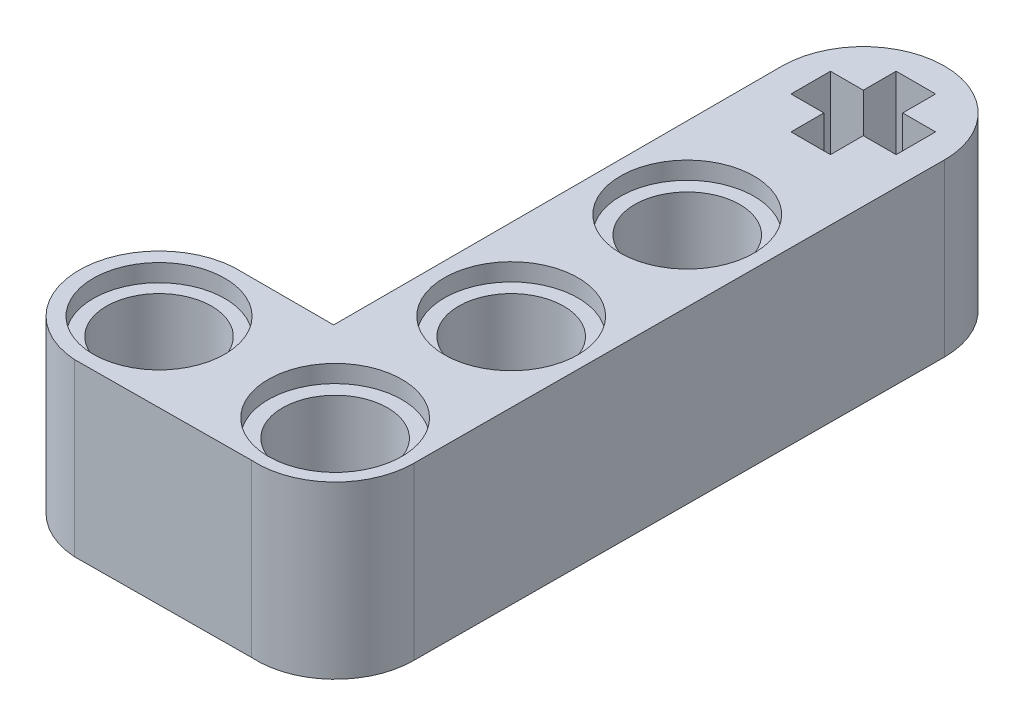
ISO-10303-21;
HEADER;
FILE_DESCRIPTION(('STEP AP214'),'2;1');
FILE_NAME('part.step','',(''),(''),'','','');
FILE_SCHEMA(('AUTOMOTIVE_DESIGN { 1 0 10303 214 1 1 1 1 }'));
ENDSEC;
DATA;
#1=APPLICATION_CONTEXT('core data for automotive mechanical design processes');
#2=APPLICATION_PROTOCOL_DEFINITION('international standard','automotive_design',2000,#1);
#3=PRODUCT_CONTEXT('',#1,'mechanical');
#4=PRODUCT('Part','Part','',(#3));
#5=PRODUCT_RELATED_PRODUCT_CATEGORY('part','',(#4));
#6=PRODUCT_DEFINITION_FORMATION('','',#4);
#7=PRODUCT_DEFINITION_CONTEXT('part definition',#1,'design');
#8=PRODUCT_DEFINITION('design','',#6,#7);
#9=PRODUCT_DEFINITION_SHAPE('','',#8);
#10=(LENGTH_UNIT() NAMED_UNIT(*) SI_UNIT(.MILLI.,.METRE.));
#11=(NAMED_UNIT(*) PLANE_ANGLE_UNIT() SI_UNIT($,.RADIAN.));
#12=(NAMED_UNIT(*) SI_UNIT($,.STERADIAN.) SOLID_ANGLE_UNIT());
#13=UNCERTAINTY_MEASURE_WITH_UNIT(LENGTH_MEASURE(1.E-05),#10,'distance_accuracy_value','');
#14=(GEOMETRIC_REPRESENTATION_CONTEXT(3) GLOBAL_UNCERTAINTY_ASSIGNED_CONTEXT((#13)) GLOBAL_UNIT_ASSIGNED_CONTEXT((#10,
#11,#12)) REPRESENTATION_CONTEXT('',''));
#15=CARTESIAN_POINT('',(0.,0.,0.));
#16=DIRECTION('',(0.,0.,1.));
#17=DIRECTION('',(1.,0.,0.));
#18=AXIS2_PLACEMENT_3D('',#15,#16,#17);
#19=CARTESIAN_POINT('',(-3.94907080353848,7.8,0.));
#20=DIRECTION('',(0.,-1.,0.));
#21=DIRECTION('',(0.,0.,-1.));
#22=AXIS2_PLACEMENT_3D('',#19,#20,#21);
#23=CYLINDRICAL_SURFACE('',#22,2.4);
#24=CARTESIAN_POINT('',(-3.94907080353848,7.,0.));
#25=DIRECTION('',(0.,1.,0.));
#26=DIRECTION('',(0.,0.,1.));
#27=AXIS2_PLACEMENT_3D('',#24,#25,#26);
#28=CIRCLE('',#27,2.4);
#29=CARTESIAN_POINT('',(-3.94907080353848,7.,2.4));
#30=VERTEX_POINT('',#29);
#31=EDGE_CURVE('E213',#30,#30,#28,.T.);
#32=ORIENTED_EDGE('',*,*,#31,.T.);
#33=EDGE_LOOP('',(#32));
#34=FACE_BOUND('',#33,.T.);
#35=CARTESIAN_POINT('',(-3.94907080353848,0.8,0.));
#36=DIRECTION('',(0.,-1.,0.));
#37=DIRECTION('',(0.,0.,-1.));
#38=AXIS2_PLACEMENT_3D('',#35,#36,#37);
#39=CIRCLE('',#38,2.4);
#40=CARTESIAN_POINT('',(-3.94907080353848,0.8,-2.4));
#41=VERTEX_POINT('',#40);
#42=EDGE_CURVE('E37',#41,#41,#39,.T.);
#43=ORIENTED_EDGE('',*,*,#42,.T.);
#44=EDGE_LOOP('',(#43));
#45=FACE_BOUND('',#44,.T.);
#46=ADVANCED_FACE('F33',(#34,#45),#23,.F.);
#47=CARTESIAN_POINT('',(4.09092919646151,7.8,0.));
#48=DIRECTION('',(0.,-1.,0.));
#49=DIRECTION('',(0.,0.,-1.));
#50=AXIS2_PLACEMENT_3D('',#47,#48,#49);
#51=CYLINDRICAL_SURFACE('',#50,2.4);
#52=CARTESIAN_POINT('',(4.09092919646151,7.,0.));
#53=DIRECTION('',(0.,1.,0.));
#54=DIRECTION('',(0.,0.,1.));
#55=AXIS2_PLACEMENT_3D('',#52,#53,#54);
#56=CIRCLE('',#55,2.4);
#57=CARTESIAN_POINT('',(4.09092919646151,7.,2.4));
#58=VERTEX_POINT('',#57);
#59=EDGE_CURVE('E316',#58,#58,#56,.T.);
#60=ORIENTED_EDGE('',*,*,#59,.T.);
#61=EDGE_LOOP('',(#60));
#62=FACE_BOUND('',#61,.T.);
#63=CARTESIAN_POINT('',(4.09092919646151,0.8,0.));
#64=DIRECTION('',(0.,-1.,0.));
#65=DIRECTION('',(0.,0.,-1.));
#66=AXIS2_PLACEMENT_3D('',#63,#64,#65);
#67=CIRCLE('',#66,2.4);
#68=CARTESIAN_POINT('',(4.09092919646151,0.8,-2.4));
#69=VERTEX_POINT('',#68);
#70=EDGE_CURVE('E327',#69,#69,#67,.T.);
#71=ORIENTED_EDGE('',*,*,#70,.T.);
#72=EDGE_LOOP('',(#71));
#73=FACE_BOUND('',#72,.T.);
#74=ADVANCED_FACE('F457',(#62,#73),#51,.F.);
#75=CARTESIAN_POINT('',(4.09092919646151,7.8,-16.08));
#76=DIRECTION('',(0.,-1.,0.));
#77=DIRECTION('',(0.,0.,-1.));
#78=AXIS2_PLACEMENT_3D('',#75,#76,#77);
#79=CYLINDRICAL_SURFACE('',#78,2.4);
#80=CARTESIAN_POINT('',(4.09092919646151,7.,-16.08));
#81=DIRECTION('',(0.,1.,0.));
#82=DIRECTION('',(0.,0.,1.));
#83=AXIS2_PLACEMENT_3D('',#80,#81,#82);
#84=CIRCLE('',#83,2.4);
#85=CARTESIAN_POINT('',(4.09092919646151,7.,-13.68));
#86=VERTEX_POINT('',#85);
#87=EDGE_CURVE('E312',#86,#86,#84,.T.);
#88=ORIENTED_EDGE('',*,*,#87,.T.);
#89=EDGE_LOOP('',(#88));
#90=FACE_BOUND('',#89,.T.);
#91=CARTESIAN_POINT('',(4.09092919646151,0.8,-16.08));
#92=DIRECTION('',(0.,-1.,0.));
#93=DIRECTION('',(0.,0.,-1.));
#94=AXIS2_PLACEMENT_3D('',#91,#92,#93);
#95=CIRCLE('',#94,2.4);
#96=CARTESIAN_POINT('',(4.09092919646151,0.8,-18.48));
#97=VERTEX_POINT('',#96);
#98=EDGE_CURVE('E324',#97,#97,#95,.T.);
#99=ORIENTED_EDGE('',*,*,#98,.T.);
#100=EDGE_LOOP('',(#99));
#101=FACE_BOUND('',#100,.T.);
#102=ADVANCED_FACE('F463',(#90,#101),#79,.F.);
#103=CARTESIAN_POINT('',(4.09092919646151,7.8,-8.04));
#104=DIRECTION('',(0.,-1.,0.));
#105=DIRECTION('',(0.,0.,-1.));
#106=AXIS2_PLACEMENT_3D('',#103,#104,#105);
#107=CYLINDRICAL_SURFACE('',#106,2.4);
#108=CARTESIAN_POINT('',(4.09092919646151,7.,-8.04));
#109=DIRECTION('',(0.,1.,0.));
#110=DIRECTION('',(0.,0.,1.));
#111=AXIS2_PLACEMENT_3D('',#108,#109,#110);
#112=CIRCLE('',#111,2.4);
#113=CARTESIAN_POINT('',(4.09092919646151,7.,-5.64));
#114=VERTEX_POINT('',#113);
#115=EDGE_CURVE('E309',#114,#114,#112,.T.);
#116=ORIENTED_EDGE('',*,*,#115,.T.);
#117=EDGE_LOOP('',(#116));
#118=FACE_BOUND('',#117,.T.);
#119=CARTESIAN_POINT('',(4.09092919646151,0.8,-8.04));
#120=DIRECTION('',(0.,-1.,0.));
#121=DIRECTION('',(0.,0.,-1.));
#122=AXIS2_PLACEMENT_3D('',#119,#120,#121);
#123=CIRCLE('',#122,2.4);
#124=CARTESIAN_POINT('',(4.09092919646151,0.8,-10.44));
#125=VERTEX_POINT('',#124);
#126=EDGE_CURVE('E321',#125,#125,#123,.T.);
#127=ORIENTED_EDGE('',*,*,#126,.T.);
#128=EDGE_LOOP('',(#127));
#129=FACE_BOUND('',#128,.T.);
#130=ADVANCED_FACE('F469',(#118,#129),#107,.F.);
#131=CARTESIAN_POINT('',(-3.94907080353848,7.8,0.));
#132=DIRECTION('',(0.,1.,0.));
#133=DIRECTION('',(0.,0.,1.));
#134=AXIS2_PLACEMENT_3D('',#131,#132,#133);
#135=PLANE('',#134);
#136=CARTESIAN_POINT('',(-3.94907080353848,7.8,0.));
#137=DIRECTION('',(0.,1.,0.));
#138=DIRECTION('',(0.,0.,1.));
#139=AXIS2_PLACEMENT_3D('',#136,#137,#138);
#140=CIRCLE('',#139,3.005);
#141=CARTESIAN_POINT('',(-3.94907080353848,7.8,3.005));
#142=VERTEX_POINT('',#141);
#143=EDGE_CURVE('E354',#142,#142,#140,.T.);
#144=ORIENTED_EDGE('',*,*,#143,.F.);
#145=EDGE_LOOP('',(#144));
#146=FACE_BOUND('',#145,.T.);
#147=CARTESIAN_POINT('',(4.09092919646151,7.8,0.));
#148=DIRECTION('',(0.,1.,0.));
#149=DIRECTION('',(0.,0.,1.));
#150=AXIS2_PLACEMENT_3D('',#147,#148,#149);
#151=CIRCLE('',#150,3.05);
#152=CARTESIAN_POINT('',(4.09092919646151,7.8,3.05));
#153=VERTEX_POINT('',#152);
#154=EDGE_CURVE('E348',#153,#153,#151,.T.);
#155=ORIENTED_EDGE('',*,*,#154,.F.);
#156=EDGE_LOOP('',(#155));
#157=FACE_BOUND('',#156,.T.);
#158=CARTESIAN_POINT('',(4.09092919646151,7.8,-8.04));
#159=DIRECTION('',(0.,1.,0.));
#160=DIRECTION('',(0.,0.,1.));
#161=AXIS2_PLACEMENT_3D('',#158,#159,#160);
#162=CIRCLE('',#161,3.05);
#163=CARTESIAN_POINT('',(4.09092919646151,7.8,-4.99));
#164=VERTEX_POINT('',#163);
#165=EDGE_CURVE('E340',#164,#164,#162,.T.);
#166=ORIENTED_EDGE('',*,*,#165,.F.);
#167=EDGE_LOOP('',(#166));
#168=FACE_BOUND('',#167,.T.);
#169=CARTESIAN_POINT('',(4.09092919646151,7.8,-16.08));
#170=DIRECTION('',(0.,1.,0.));
#171=DIRECTION('',(0.,0.,1.));
#172=AXIS2_PLACEMENT_3D('',#169,#170,#171);
#173=CIRCLE('',#172,3.05);
#174=CARTESIAN_POINT('',(4.09092919646151,7.8,-13.03));
#175=VERTEX_POINT('',#174);
#176=EDGE_CURVE('E332',#175,#175,#173,.T.);
#177=ORIENTED_EDGE('',*,*,#176,.F.);
#178=EDGE_LOOP('',(#177));
#179=FACE_BOUND('',#178,.T.);
#180=DIRECTION('',(1.,0.,0.));
#181=VECTOR('',#180,1.);
#182=CARTESIAN_POINT('',(4.99092919646151,7.8,-23.2200000000003));
#183=LINE('',#182,#181);
#184=CARTESIAN_POINT('',(4.99092919646151,7.8,-23.2200000000003));
#185=VERTEX_POINT('',#184);
#186=CARTESIAN_POINT('',(6.49092919646152,7.8,-23.2200000000003));
#187=VERTEX_POINT('',#186);
#188=EDGE_CURVE('E174',#185,#187,#183,.T.);
#189=ORIENTED_EDGE('',*,*,#188,.F.);
#190=DIRECTION('',(0.,0.,-1.));
#191=VECTOR('',#190,1.);
#192=CARTESIAN_POINT('',(4.99092919646151,7.8,-23.2200000000003));
#193=LINE('',#192,#191);
#194=CARTESIAN_POINT('',(4.99092919646151,7.8,-21.7200000000003));
#195=VERTEX_POINT('',#194);
#196=EDGE_CURVE('E166',#195,#185,#193,.T.);
#197=ORIENTED_EDGE('',*,*,#196,.F.);
#198=DIRECTION('',(1.,0.,0.));
#199=VECTOR('',#198,1.);
#200=CARTESIAN_POINT('',(3.19092919646151,7.8,-21.7200000000003));
#201=LINE('',#200,#199);
#202=CARTESIAN_POINT('',(3.19092919646151,7.8,-21.7200000000003));
#203=VERTEX_POINT('',#202);
#204=EDGE_CURVE('E210',#203,#195,#201,.T.);
#205=ORIENTED_EDGE('',*,*,#204,.F.);
#206=DIRECTION('',(0.,0.,1.));
#207=VECTOR('',#206,1.);
#208=CARTESIAN_POINT('',(3.19092919646151,7.8,-23.2200000000003));
#209=LINE('',#208,#207);
#210=CARTESIAN_POINT('',(3.19092919646151,7.8,-23.2200000000003));
#211=VERTEX_POINT('',#210);
#212=EDGE_CURVE('E208',#211,#203,#209,.T.);
#213=ORIENTED_EDGE('',*,*,#212,.F.);
#214=DIRECTION('',(1.,0.,0.));
#215=VECTOR('',#214,1.);
#216=CARTESIAN_POINT('',(1.69092919646151,7.8,-23.2200000000003));
#217=LINE('',#216,#215);
#218=CARTESIAN_POINT('',(1.69092919646151,7.8,-23.2200000000003));
#219=VERTEX_POINT('',#218);
#220=EDGE_CURVE('E206',#219,#211,#217,.T.);
#221=ORIENTED_EDGE('',*,*,#220,.F.);
#222=DIRECTION('',(0.,0.,1.));
#223=VECTOR('',#222,1.);
#224=CARTESIAN_POINT('',(1.69092919646151,7.8,-25.0200000000003));
#225=LINE('',#224,#223);
#226=CARTESIAN_POINT('',(1.69092919646151,7.8,-25.0200000000003));
#227=VERTEX_POINT('',#226);
#228=EDGE_CURVE('E204',#227,#219,#225,.T.);
#229=ORIENTED_EDGE('',*,*,#228,.F.);
#230=DIRECTION('',(-1.,0.,0.));
#231=VECTOR('',#230,1.);
#232=CARTESIAN_POINT('',(1.69092919646151,7.8,-25.0200000000003));
#233=LINE('',#232,#231);
#234=CARTESIAN_POINT('',(3.19092919646151,7.8,-25.0200000000003));
#235=VERTEX_POINT('',#234);
#236=EDGE_CURVE('E202',#235,#227,#233,.T.);
#237=ORIENTED_EDGE('',*,*,#236,.F.);
#238=DIRECTION('',(0.,0.,1.));
#239=VECTOR('',#238,1.);
#240=CARTESIAN_POINT('',(3.19092919646151,7.8,-26.5200000000003));
#241=LINE('',#240,#239);
#242=CARTESIAN_POINT('',(3.19092919646151,7.8,-26.5200000000003));
#243=VERTEX_POINT('',#242);
#244=EDGE_CURVE('E200',#243,#235,#241,.T.);
#245=ORIENTED_EDGE('',*,*,#244,.F.);
#246=DIRECTION('',(-1.,0.,0.));
#247=VECTOR('',#246,1.);
#248=CARTESIAN_POINT('',(3.19092919646151,7.8,-26.5200000000003));
#249=LINE('',#248,#247);
#250=CARTESIAN_POINT('',(4.99092919646151,7.8,-26.5200000000003));
#251=VERTEX_POINT('',#250);
#252=EDGE_CURVE('E198',#251,#243,#249,.T.);
#253=ORIENTED_EDGE('',*,*,#252,.F.);
#254=DIRECTION('',(0.,0.,-1.));
#255=VECTOR('',#254,1.);
#256=CARTESIAN_POINT('',(4.99092919646151,7.8,-26.5200000000003));
#257=LINE('',#256,#255);
#258=CARTESIAN_POINT('',(4.99092919646151,7.8,-25.0200000000003));
#259=VERTEX_POINT('',#258);
#260=EDGE_CURVE('E196',#259,#251,#257,.T.);
#261=ORIENTED_EDGE('',*,*,#260,.F.);
#262=DIRECTION('',(-1.,0.,0.));
#263=VECTOR('',#262,1.);
#264=CARTESIAN_POINT('',(4.99092919646151,7.8,-25.0200000000003));
#265=LINE('',#264,#263);
#266=CARTESIAN_POINT('',(6.49092919646151,7.8,-25.0200000000003));
#267=VERTEX_POINT('',#266);
#268=EDGE_CURVE('E191',#267,#259,#265,.T.);
#269=ORIENTED_EDGE('',*,*,#268,.F.);
#270=DIRECTION('',(0.,0.,-1.));
#271=VECTOR('',#270,1.);
#272=CARTESIAN_POINT('',(6.49092919646151,7.8,-25.0200000000003));
#273=LINE('',#272,#271);
#274=EDGE_CURVE('E189',#187,#267,#273,.T.);
#275=ORIENTED_EDGE('',*,*,#274,.F.);
#276=EDGE_LOOP('',(#189,#197,#205,#213,#221,#229,#237,#245,#253,#261,#269,#275));
#277=FACE_BOUND('',#276,.T.);
#278=CARTESIAN_POINT('',(-3.94907080353848,7.8,0.));
#279=DIRECTION('',(0.,1.,0.));
#280=DIRECTION('',(0.,0.,1.));
#281=AXIS2_PLACEMENT_3D('',#278,#279,#280);
#282=CIRCLE('',#281,3.65000206412482);
#283=CARTESIAN_POINT('',(-3.72319834090905,7.8,-3.64301068279919));
#284=VERTEX_POINT('',#283);
#285=CARTESIAN_POINT('',(-4.17494275523309,7.8,3.64300244212645));
#286=VERTEX_POINT('',#285);
#287=EDGE_CURVE('E263',#284,#286,#282,.T.);
#288=ORIENTED_EDGE('',*,*,#287,.T.);
#289=DIRECTION('',(0.999972162960093,0.,-0.00746145461117787));
#290=VECTOR('',#289,1.);
#291=CARTESIAN_POINT('',(-4.17494275523309,7.8,3.64300244212645));
#292=LINE('',#291,#290);
#293=CARTESIAN_POINT('',(3.86678286484987,7.8,3.58299780106507));
#294=VERTEX_POINT('',#293);
#295=EDGE_CURVE('E266',#286,#294,#292,.T.);
#296=ORIENTED_EDGE('',*,*,#295,.T.);
#297=CARTESIAN_POINT('',(4.09092919646151,7.8,0.));
#298=DIRECTION('',(0.,1.,0.));
#299=DIRECTION('',(0.,0.,1.));
#300=AXIS2_PLACEMENT_3D('',#297,#298,#299);
#301=CIRCLE('',#300,3.59000206412365);
#302=CARTESIAN_POINT('',(7.68092398356099,7.8,-0.00722834771103826));
#303=VERTEX_POINT('',#302);
#304=EDGE_CURVE('E269',#294,#303,#301,.T.);
#305=ORIENTED_EDGE('',*,*,#304,.T.);
#306=DIRECTION('',(0.00497694153571674,0.,-0.99998761494978));
#307=VECTOR('',#306,1.);
#308=CARTESIAN_POINT('',(7.68092398356099,7.8,-0.00722834771103826));
#309=LINE('',#308,#307);
#310=CARTESIAN_POINT('',(7.80093332470161,7.8,-24.1200000083128));
#311=VERTEX_POINT('',#310);
#312=EDGE_CURVE('E271',#303,#311,#309,.T.);
#313=ORIENTED_EDGE('',*,*,#312,.T.);
#314=CARTESIAN_POINT('',(4.09092919646151,7.8,-24.1200000000003));
#315=DIRECTION('',(0.,1.,0.));
#316=DIRECTION('',(0.,0.,1.));
#317=AXIS2_PLACEMENT_3D('',#314,#315,#316);
#318=CIRCLE('',#317,3.7100041282401);
#319=CARTESIAN_POINT('',(0.380925068221416,7.8,-24.12));
#320=VERTEX_POINT('',#319);
#321=EDGE_CURVE('E273',#311,#320,#318,.T.);
#322=ORIENTED_EDGE('',*,*,#321,.T.);
#323=DIRECTION('',(0.,0.,1.));
#324=VECTOR('',#323,1.);
#325=CARTESIAN_POINT('',(0.380925068221421,7.8,-3.64301068279919));
#326=LINE('',#325,#324);
#327=CARTESIAN_POINT('',(0.380925068221421,7.8,-3.64301068279919));
#328=VERTEX_POINT('',#327);
#329=EDGE_CURVE('E275',#320,#328,#326,.T.);
#330=ORIENTED_EDGE('',*,*,#329,.T.);
#331=DIRECTION('',(-1.,0.,0.));
#332=VECTOR('',#331,1.);
#333=CARTESIAN_POINT('',(-3.72319834090905,7.8,-3.64301068279919));
#334=LINE('',#333,#332);
#335=EDGE_CURVE('E277',#328,#284,#334,.T.);
#336=ORIENTED_EDGE('',*,*,#335,.T.);
#337=EDGE_LOOP('',(#288,#296,#305,#313,#322,#330,#336));
#338=FACE_BOUND('',#337,.T.);
#339=ADVANCED_FACE('F186',(#146,#157,#168,#179,#277,#338),#135,.T.);
#340=CARTESIAN_POINT('',(-3.94907080353848,0.,0.));
#341=DIRECTION('',(0.,1.,0.));
#342=DIRECTION('',(0.,0.,1.));
#343=AXIS2_PLACEMENT_3D('',#340,#341,#342);
#344=PLANE('',#343);
#345=CARTESIAN_POINT('',(-3.94907080353848,0.,0.));
#346=DIRECTION('',(0.,-1.,0.));
#347=DIRECTION('',(0.,0.,-1.));
#348=AXIS2_PLACEMENT_3D('',#345,#346,#347);
#349=CIRCLE('',#348,3.05);
#350=CARTESIAN_POINT('',(-3.94907080353848,0.,-3.05));
#351=VERTEX_POINT('',#350);
#352=EDGE_CURVE('E377',#351,#351,#349,.T.);
#353=ORIENTED_EDGE('',*,*,#352,.F.);
#354=EDGE_LOOP('',(#353));
#355=FACE_BOUND('',#354,.T.);
#356=CARTESIAN_POINT('',(4.09092919646151,0.,0.));
#357=DIRECTION('',(0.,-1.,0.));
#358=DIRECTION('',(0.,0.,-1.));
#359=AXIS2_PLACEMENT_3D('',#356,#357,#358);
#360=CIRCLE('',#359,3.05);
#361=CARTESIAN_POINT('',(4.09092919646151,0.,-3.05));
#362=VERTEX_POINT('',#361);
#363=EDGE_CURVE('E371',#362,#362,#360,.T.);
#364=ORIENTED_EDGE('',*,*,#363,.F.);
#365=EDGE_LOOP('',(#364));
#366=FACE_BOUND('',#365,.T.);
#367=CARTESIAN_POINT('',(4.09092919646151,0.,-8.04));
#368=DIRECTION('',(0.,-1.,0.));
#369=DIRECTION('',(0.,0.,-1.));
#370=AXIS2_PLACEMENT_3D('',#367,#368,#369);
#371=CIRCLE('',#370,3.05);
#372=CARTESIAN_POINT('',(4.09092919646151,0.,-11.09));
#373=VERTEX_POINT('',#372);
#374=EDGE_CURVE('E365',#373,#373,#371,.T.);
#375=ORIENTED_EDGE('',*,*,#374,.F.);
#376=EDGE_LOOP('',(#375));
#377=FACE_BOUND('',#376,.T.);
#378=CARTESIAN_POINT('',(4.09092919646151,0.,-16.08));
#379=DIRECTION('',(0.,-1.,0.));
#380=DIRECTION('',(0.,0.,-1.));
#381=AXIS2_PLACEMENT_3D('',#378,#379,#380);
#382=CIRCLE('',#381,3.05);
#383=CARTESIAN_POINT('',(4.09092919646151,0.,-19.13));
#384=VERTEX_POINT('',#383);
#385=EDGE_CURVE('E359',#384,#384,#382,.T.);
#386=ORIENTED_EDGE('',*,*,#385,.F.);
#387=EDGE_LOOP('',(#386));
#388=FACE_BOUND('',#387,.T.);
#389=CARTESIAN_POINT('',(-3.94907080353848,0.,0.));
#390=DIRECTION('',(0.,1.,0.));
#391=DIRECTION('',(0.,0.,1.));
#392=AXIS2_PLACEMENT_3D('',#389,#390,#391);
#393=CIRCLE('',#392,3.65000206412482);
#394=CARTESIAN_POINT('',(-3.72319834090905,0.,-3.64301068279919));
#395=VERTEX_POINT('',#394);
#396=CARTESIAN_POINT('',(-4.17494275523309,0.,3.64300244212645));
#397=VERTEX_POINT('',#396);
#398=EDGE_CURVE('E182',#395,#397,#393,.T.);
#399=ORIENTED_EDGE('',*,*,#398,.F.);
#400=DIRECTION('',(-1.,0.,0.));
#401=VECTOR('',#400,1.);
#402=CARTESIAN_POINT('',(-3.72319834090905,0.,-3.64301068279919));
#403=LINE('',#402,#401);
#404=CARTESIAN_POINT('',(0.380925068221421,0.,-3.64301068279919));
#405=VERTEX_POINT('',#404);
#406=EDGE_CURVE('E267',#405,#395,#403,.T.);
#407=ORIENTED_EDGE('',*,*,#406,.F.);
#408=DIRECTION('',(0.,0.,1.));
#409=VECTOR('',#408,1.);
#410=CARTESIAN_POINT('',(0.380925068221421,0.,-3.64301068279919));
#411=LINE('',#410,#409);
#412=CARTESIAN_POINT('',(0.380925068221416,0.,-24.12));
#413=VERTEX_POINT('',#412);
#414=EDGE_CURVE('E290',#413,#405,#411,.T.);
#415=ORIENTED_EDGE('',*,*,#414,.F.);
#416=CARTESIAN_POINT('',(4.09092919646151,0.,-24.1200000000003));
#417=DIRECTION('',(0.,1.,0.));
#418=DIRECTION('',(0.,0.,1.));
#419=AXIS2_PLACEMENT_3D('',#416,#417,#418);
#420=CIRCLE('',#419,3.7100041282401);
#421=CARTESIAN_POINT('',(7.80093332470161,0.,-24.1200000083128));
#422=VERTEX_POINT('',#421);
#423=EDGE_CURVE('E288',#422,#413,#420,.T.);
#424=ORIENTED_EDGE('',*,*,#423,.F.);
#425=DIRECTION('',(0.00497694153571674,0.,-0.99998761494978));
#426=VECTOR('',#425,1.);
#427=CARTESIAN_POINT('',(7.68092398356099,0.,-0.00722834771103826));
#428=LINE('',#427,#426);
#429=CARTESIAN_POINT('',(7.68092398356099,0.,-0.00722834771103826));
#430=VERTEX_POINT('',#429);
#431=EDGE_CURVE('E286',#430,#422,#428,.T.);
#432=ORIENTED_EDGE('',*,*,#431,.F.);
#433=CARTESIAN_POINT('',(4.09092919646151,0.,0.));
#434=DIRECTION('',(0.,1.,0.));
#435=DIRECTION('',(0.,0.,1.));
#436=AXIS2_PLACEMENT_3D('',#433,#434,#435);
#437=CIRCLE('',#436,3.59000206412365);
#438=CARTESIAN_POINT('',(3.86678286484987,0.,3.58299780106507));
#439=VERTEX_POINT('',#438);
#440=EDGE_CURVE('E284',#439,#430,#437,.T.);
#441=ORIENTED_EDGE('',*,*,#440,.F.);
#442=DIRECTION('',(0.999972162960093,0.,-0.00746145461117787));
#443=VECTOR('',#442,1.);
#444=CARTESIAN_POINT('',(-4.17494275523309,0.,3.64300244212645));
#445=LINE('',#444,#443);
#446=EDGE_CURVE('E282',#397,#439,#445,.T.);
#447=ORIENTED_EDGE('',*,*,#446,.F.);
#448=EDGE_LOOP('',(#399,#407,#415,#424,#432,#441,#447));
#449=FACE_BOUND('',#448,.T.);
#450=DIRECTION('',(0.,0.,-1.));
#451=VECTOR('',#450,1.);
#452=CARTESIAN_POINT('',(4.99092919646151,0.,-23.2200000000003));
#453=LINE('',#452,#451);
#454=CARTESIAN_POINT('',(4.99092919646151,0.,-21.7200000000003));
#455=VERTEX_POINT('',#454);
#456=CARTESIAN_POINT('',(4.99092919646151,0.,-23.2200000000003));
#457=VERTEX_POINT('',#456);
#458=EDGE_CURVE('E58',#455,#457,#453,.T.);
#459=ORIENTED_EDGE('',*,*,#458,.T.);
#460=DIRECTION('',(1.,0.,0.));
#461=VECTOR('',#460,1.);
#462=CARTESIAN_POINT('',(4.99092919646151,0.,-23.2200000000003));
#463=LINE('',#462,#461);
#464=CARTESIAN_POINT('',(6.49092919646152,0.,-23.2200000000003));
#465=VERTEX_POINT('',#464);
#466=EDGE_CURVE('E181',#457,#465,#463,.T.);
#467=ORIENTED_EDGE('',*,*,#466,.T.);
#468=DIRECTION('',(0.,0.,-1.));
#469=VECTOR('',#468,1.);
#470=CARTESIAN_POINT('',(6.49092919646151,0.,-25.0200000000003));
#471=LINE('',#470,#469);
#472=CARTESIAN_POINT('',(6.49092919646151,0.,-25.0200000000003));
#473=VERTEX_POINT('',#472);
#474=EDGE_CURVE('E215',#465,#473,#471,.T.);
#475=ORIENTED_EDGE('',*,*,#474,.T.);
#476=DIRECTION('',(-1.,0.,0.));
#477=VECTOR('',#476,1.);
#478=CARTESIAN_POINT('',(4.99092919646151,0.,-25.0200000000003));
#479=LINE('',#478,#477);
#480=CARTESIAN_POINT('',(4.99092919646151,0.,-25.0200000000003));
#481=VERTEX_POINT('',#480);
#482=EDGE_CURVE('E218',#473,#481,#479,.T.);
#483=ORIENTED_EDGE('',*,*,#482,.T.);
#484=DIRECTION('',(0.,0.,-1.));
#485=VECTOR('',#484,1.);
#486=CARTESIAN_POINT('',(4.99092919646151,0.,-26.5200000000003));
#487=LINE('',#486,#485);
#488=CARTESIAN_POINT('',(4.99092919646151,0.,-26.5200000000003));
#489=VERTEX_POINT('',#488);
#490=EDGE_CURVE('E221',#481,#489,#487,.T.);
#491=ORIENTED_EDGE('',*,*,#490,.T.);
#492=DIRECTION('',(-1.,0.,0.));
#493=VECTOR('',#492,1.);
#494=CARTESIAN_POINT('',(3.19092919646151,0.,-26.5200000000003));
#495=LINE('',#494,#493);
#496=CARTESIAN_POINT('',(3.19092919646151,0.,-26.5200000000003));
#497=VERTEX_POINT('',#496);
#498=EDGE_CURVE('E224',#489,#497,#495,.T.);
#499=ORIENTED_EDGE('',*,*,#498,.T.);
#500=DIRECTION('',(0.,0.,1.));
#501=VECTOR('',#500,1.);
#502=CARTESIAN_POINT('',(3.19092919646151,0.,-26.5200000000003));
#503=LINE('',#502,#501);
#504=CARTESIAN_POINT('',(3.19092919646151,0.,-25.0200000000003));
#505=VERTEX_POINT('',#504);
#506=EDGE_CURVE('E227',#497,#505,#503,.T.);
#507=ORIENTED_EDGE('',*,*,#506,.T.);
#508=DIRECTION('',(-1.,0.,0.));
#509=VECTOR('',#508,1.);
#510=CARTESIAN_POINT('',(1.69092919646151,0.,-25.0200000000003));
#511=LINE('',#510,#509);
#512=CARTESIAN_POINT('',(1.69092919646151,0.,-25.0200000000003));
#513=VERTEX_POINT('',#512);
#514=EDGE_CURVE('E230',#505,#513,#511,.T.);
#515=ORIENTED_EDGE('',*,*,#514,.T.);
#516=DIRECTION('',(0.,0.,1.));
#517=VECTOR('',#516,1.);
#518=CARTESIAN_POINT('',(1.69092919646151,0.,-25.0200000000003));
#519=LINE('',#518,#517);
#520=CARTESIAN_POINT('',(1.69092919646151,0.,-23.2200000000003));
#521=VERTEX_POINT('',#520);
#522=EDGE_CURVE('E233',#513,#521,#519,.T.);
#523=ORIENTED_EDGE('',*,*,#522,.T.);
#524=DIRECTION('',(1.,0.,0.));
#525=VECTOR('',#524,1.);
#526=CARTESIAN_POINT('',(1.69092919646151,0.,-23.2200000000003));
#527=LINE('',#526,#525);
#528=CARTESIAN_POINT('',(3.19092919646151,0.,-23.2200000000003));
#529=VERTEX_POINT('',#528);
#530=EDGE_CURVE('E236',#521,#529,#527,.T.);
#531=ORIENTED_EDGE('',*,*,#530,.T.);
#532=DIRECTION('',(0.,0.,1.));
#533=VECTOR('',#532,1.);
#534=CARTESIAN_POINT('',(3.19092919646151,0.,-23.2200000000003));
#535=LINE('',#534,#533);
#536=CARTESIAN_POINT('',(3.19092919646151,0.,-21.7200000000003));
#537=VERTEX_POINT('',#536);
#538=EDGE_CURVE('E239',#529,#537,#535,.T.);
#539=ORIENTED_EDGE('',*,*,#538,.T.);
#540=DIRECTION('',(1.,0.,0.));
#541=VECTOR('',#540,1.);
#542=CARTESIAN_POINT('',(3.19092919646151,0.,-21.7200000000003));
#543=LINE('',#542,#541);
#544=EDGE_CURVE('E175',#537,#455,#543,.T.);
#545=ORIENTED_EDGE('',*,*,#544,.T.);
#546=EDGE_LOOP('',(#459,#467,#475,#483,#491,#499,#507,#515,#523,#531,#539,#545));
#547=FACE_BOUND('',#546,.T.);
#548=ADVANCED_FACE('F392',(#355,#366,#377,#388,#449,#547),#344,.F.);
#549=CARTESIAN_POINT('',(-3.94907080353848,7.8,0.));
#550=DIRECTION('',(0.,-1.,0.));
#551=DIRECTION('',(0.,0.,-1.));
#552=AXIS2_PLACEMENT_3D('',#549,#550,#551);
#553=CYLINDRICAL_SURFACE('',#552,3.65000206412482);
#554=ORIENTED_EDGE('',*,*,#398,.T.);
#555=DIRECTION('',(0.,-1.,0.));
#556=VECTOR('',#555,1.);
#557=CARTESIAN_POINT('',(-4.17494275523309,7.8,3.64300244212645));
#558=LINE('',#557,#556);
#559=EDGE_CURVE('E11',#286,#397,#558,.T.);
#560=ORIENTED_EDGE('',*,*,#559,.F.);
#561=ORIENTED_EDGE('',*,*,#287,.F.);
#562=DIRECTION('',(0.,-1.,0.));
#563=VECTOR('',#562,1.);
#564=CARTESIAN_POINT('',(-3.72319834090905,7.8,-3.64301068279919));
#565=LINE('',#564,#563);
#566=EDGE_CURVE('E279',#284,#395,#565,.T.);
#567=ORIENTED_EDGE('',*,*,#566,.T.);
#568=EDGE_LOOP('',(#554,#560,#561,#567));
#569=FACE_BOUND('',#568,.T.);
#570=ADVANCED_FACE('F35',(#569),#553,.T.);
#571=CARTESIAN_POINT('',(-4.17494275523309,7.8,3.64300244212645));
#572=DIRECTION('',(-0.00746145461117786,0.,-0.999972162960092));
#573=DIRECTION('',(-0.999972162960092,0.,0.00746145461117787));
#574=AXIS2_PLACEMENT_3D('',#571,#572,#573);
#575=PLANE('',#574);
#576=ORIENTED_EDGE('',*,*,#446,.T.);
#577=DIRECTION('',(0.,-1.,0.));
#578=VECTOR('',#577,1.);
#579=CARTESIAN_POINT('',(3.86678286484987,7.8,3.58299780106507));
#580=LINE('',#579,#578);
#581=EDGE_CURVE('E42',#294,#439,#580,.T.);
#582=ORIENTED_EDGE('',*,*,#581,.F.);
#583=ORIENTED_EDGE('',*,*,#295,.F.);
#584=ORIENTED_EDGE('',*,*,#559,.T.);
#585=EDGE_LOOP('',(#576,#582,#583,#584));
#586=FACE_BOUND('',#585,.T.);
#587=ADVANCED_FACE('F490',(#586),#575,.F.);
#588=CARTESIAN_POINT('',(4.09092919646151,7.8,0.));
#589=DIRECTION('',(0.,-1.,0.));
#590=DIRECTION('',(0.,0.,-1.));
#591=AXIS2_PLACEMENT_3D('',#588,#589,#590);
#592=CYLINDRICAL_SURFACE('',#591,3.59000206412365);
#593=ORIENTED_EDGE('',*,*,#440,.T.);
#594=DIRECTION('',(0.,-1.,0.));
#595=VECTOR('',#594,1.);
#596=CARTESIAN_POINT('',(7.68092398356099,7.8,-0.00722834771103826));
#597=LINE('',#596,#595);
#598=EDGE_CURVE('E304',#303,#430,#597,.T.);
#599=ORIENTED_EDGE('',*,*,#598,.F.);
#600=ORIENTED_EDGE('',*,*,#304,.F.);
#601=ORIENTED_EDGE('',*,*,#581,.T.);
#602=EDGE_LOOP('',(#593,#599,#600,#601));
#603=FACE_BOUND('',#602,.T.);
#604=ADVANCED_FACE('F487',(#603),#592,.T.);
#605=CARTESIAN_POINT('',(7.68092398356099,7.8,-0.00722834771103826));
#606=DIRECTION('',(-0.99998761494978,0.,-0.00497694153571674));
#607=DIRECTION('',(-0.00497694153571674,0.,0.99998761494978));
#608=AXIS2_PLACEMENT_3D('',#605,#606,#607);
#609=PLANE('',#608);
#610=ORIENTED_EDGE('',*,*,#431,.T.);
#611=DIRECTION('',(0.,-1.,0.));
#612=VECTOR('',#611,1.);
#613=CARTESIAN_POINT('',(7.80093332470161,7.8,-24.1200000083128));
#614=LINE('',#613,#612);
#615=EDGE_CURVE('E301',#311,#422,#614,.T.);
#616=ORIENTED_EDGE('',*,*,#615,.F.);
#617=ORIENTED_EDGE('',*,*,#312,.F.);
#618=ORIENTED_EDGE('',*,*,#598,.T.);
#619=EDGE_LOOP('',(#610,#616,#617,#618));
#620=FACE_BOUND('',#619,.T.);
#621=ADVANCED_FACE('F483',(#620),#609,.F.);
#622=CARTESIAN_POINT('',(4.09092919646151,7.8,-24.1200000000003));
#623=DIRECTION('',(0.,-1.,0.));
#624=DIRECTION('',(0.,0.,-1.));
#625=AXIS2_PLACEMENT_3D('',#622,#623,#624);
#626=CYLINDRICAL_SURFACE('',#625,3.7100041282401);
#627=ORIENTED_EDGE('',*,*,#423,.T.);
#628=DIRECTION('',(0.,-1.,0.));
#629=VECTOR('',#628,1.);
#630=CARTESIAN_POINT('',(0.380925068221416,7.8,-24.12));
#631=LINE('',#630,#629);
#632=EDGE_CURVE('E298',#320,#413,#631,.T.);
#633=ORIENTED_EDGE('',*,*,#632,.F.);
#634=ORIENTED_EDGE('',*,*,#321,.F.);
#635=ORIENTED_EDGE('',*,*,#615,.T.);
#636=EDGE_LOOP('',(#627,#633,#634,#635));
#637=FACE_BOUND('',#636,.T.);
#638=ADVANCED_FACE('F479',(#637),#626,.T.);
#639=CARTESIAN_POINT('',(0.380925068221421,7.8,-3.64301068279919));
#640=DIRECTION('',(1.,0.,0.));
#641=DIRECTION('',(0.,0.,-1.));
#642=AXIS2_PLACEMENT_3D('',#639,#640,#641);
#643=PLANE('',#642);
#644=ORIENTED_EDGE('',*,*,#414,.T.);
#645=DIRECTION('',(0.,-1.,0.));
#646=VECTOR('',#645,1.);
#647=CARTESIAN_POINT('',(0.380925068221421,7.8,-3.64301068279919));
#648=LINE('',#647,#646);
#649=EDGE_CURVE('E295',#328,#405,#648,.T.);
#650=ORIENTED_EDGE('',*,*,#649,.F.);
#651=ORIENTED_EDGE('',*,*,#329,.F.);
#652=ORIENTED_EDGE('',*,*,#632,.T.);
#653=EDGE_LOOP('',(#644,#650,#651,#652));
#654=FACE_BOUND('',#653,.T.);
#655=ADVANCED_FACE('F475',(#654),#643,.F.);
#656=CARTESIAN_POINT('',(-3.72319834090905,7.8,-3.64301068279919));
#657=DIRECTION('',(0.,0.,1.));
#658=DIRECTION('',(1.,0.,0.));
#659=AXIS2_PLACEMENT_3D('',#656,#657,#658);
#660=PLANE('',#659);
#661=ORIENTED_EDGE('',*,*,#406,.T.);
#662=ORIENTED_EDGE('',*,*,#566,.F.);
#663=ORIENTED_EDGE('',*,*,#335,.F.);
#664=ORIENTED_EDGE('',*,*,#649,.T.);
#665=EDGE_LOOP('',(#661,#662,#663,#664));
#666=FACE_BOUND('',#665,.T.);
#667=ADVANCED_FACE('F472',(#666),#660,.F.);
#668=CARTESIAN_POINT('',(4.99092919646151,7.8,-23.2200000000003));
#669=DIRECTION('',(-1.,0.,0.));
#670=DIRECTION('',(0.,0.,1.));
#671=AXIS2_PLACEMENT_3D('',#668,#669,#670);
#672=PLANE('',#671);
#673=ORIENTED_EDGE('',*,*,#458,.F.);
#674=DIRECTION('',(0.,-1.,0.));
#675=VECTOR('',#674,1.);
#676=CARTESIAN_POINT('',(4.99092919646151,7.8,-21.7200000000003));
#677=LINE('',#676,#675);
#678=EDGE_CURVE('E170',#195,#455,#677,.T.);
#679=ORIENTED_EDGE('',*,*,#678,.F.);
#680=ORIENTED_EDGE('',*,*,#196,.T.);
#681=DIRECTION('',(0.,-1.,0.));
#682=VECTOR('',#681,1.);
#683=CARTESIAN_POINT('',(4.99092919646151,7.8,-23.2200000000003));
#684=LINE('',#683,#682);
#685=EDGE_CURVE('E169',#185,#457,#684,.T.);
#686=ORIENTED_EDGE('',*,*,#685,.T.);
#687=EDGE_LOOP('',(#673,#679,#680,#686));
#688=FACE_BOUND('',#687,.T.);
#689=ADVANCED_FACE('F168',(#688),#672,.T.);
#690=CARTESIAN_POINT('',(4.99092919646151,7.8,-23.2200000000003));
#691=DIRECTION('',(0.,0.,-1.));
#692=DIRECTION('',(-1.,0.,0.));
#693=AXIS2_PLACEMENT_3D('',#690,#691,#692);
#694=PLANE('',#693);
#695=ORIENTED_EDGE('',*,*,#466,.F.);
#696=ORIENTED_EDGE('',*,*,#685,.F.);
#697=ORIENTED_EDGE('',*,*,#188,.T.);
#698=DIRECTION('',(0.,-1.,0.));
#699=VECTOR('',#698,1.);
#700=CARTESIAN_POINT('',(6.49092919646152,7.8,-23.2200000000003));
#701=LINE('',#700,#699);
#702=EDGE_CURVE('E183',#187,#465,#701,.T.);
#703=ORIENTED_EDGE('',*,*,#702,.T.);
#704=EDGE_LOOP('',(#695,#696,#697,#703));
#705=FACE_BOUND('',#704,.T.);
#706=ADVANCED_FACE('F178',(#705),#694,.T.);
#707=CARTESIAN_POINT('',(6.49092919646151,7.8,-25.0200000000003));
#708=DIRECTION('',(-1.,0.,0.));
#709=DIRECTION('',(0.,0.,1.));
#710=AXIS2_PLACEMENT_3D('',#707,#708,#709);
#711=PLANE('',#710);
#712=ORIENTED_EDGE('',*,*,#474,.F.);
#713=ORIENTED_EDGE('',*,*,#702,.F.);
#714=ORIENTED_EDGE('',*,*,#274,.T.);
#715=DIRECTION('',(0.,-1.,0.));
#716=VECTOR('',#715,1.);
#717=CARTESIAN_POINT('',(6.49092919646151,7.8,-25.0200000000003));
#718=LINE('',#717,#716);
#719=EDGE_CURVE('E260',#267,#473,#718,.T.);
#720=ORIENTED_EDGE('',*,*,#719,.T.);
#721=EDGE_LOOP('',(#712,#713,#714,#720));
#722=FACE_BOUND('',#721,.T.);
#723=ADVANCED_FACE('F447',(#722),#711,.T.);
#724=CARTESIAN_POINT('',(4.99092919646151,7.8,-25.0200000000003));
#725=DIRECTION('',(0.,0.,1.));
#726=DIRECTION('',(1.,0.,0.));
#727=AXIS2_PLACEMENT_3D('',#724,#725,#726);
#728=PLANE('',#727);
#729=ORIENTED_EDGE('',*,*,#482,.F.);
#730=ORIENTED_EDGE('',*,*,#719,.F.);
#731=ORIENTED_EDGE('',*,*,#268,.T.);
#732=DIRECTION('',(0.,-1.,0.));
#733=VECTOR('',#732,1.);
#734=CARTESIAN_POINT('',(4.99092919646151,7.8,-25.0200000000003));
#735=LINE('',#734,#733);
#736=EDGE_CURVE('E258',#259,#481,#735,.T.);
#737=ORIENTED_EDGE('',*,*,#736,.T.);
#738=EDGE_LOOP('',(#729,#730,#731,#737));
#739=FACE_BOUND('',#738,.T.);
#740=ADVANCED_FACE('F443',(#739),#728,.T.);
#741=CARTESIAN_POINT('',(4.99092919646151,7.8,-26.5200000000003));
#742=DIRECTION('',(-1.,0.,0.));
#743=DIRECTION('',(0.,0.,1.));
#744=AXIS2_PLACEMENT_3D('',#741,#742,#743);
#745=PLANE('',#744);
#746=ORIENTED_EDGE('',*,*,#490,.F.);
#747=ORIENTED_EDGE('',*,*,#736,.F.);
#748=ORIENTED_EDGE('',*,*,#260,.T.);
#749=DIRECTION('',(0.,-1.,0.));
#750=VECTOR('',#749,1.);
#751=CARTESIAN_POINT('',(4.99092919646151,7.8,-26.5200000000003));
#752=LINE('',#751,#750);
#753=EDGE_CURVE('E256',#251,#489,#752,.T.);
#754=ORIENTED_EDGE('',*,*,#753,.T.);
#755=EDGE_LOOP('',(#746,#747,#748,#754));
#756=FACE_BOUND('',#755,.T.);
#757=ADVANCED_FACE('F440',(#756),#745,.T.);
#758=CARTESIAN_POINT('',(3.19092919646151,7.8,-26.5200000000003));
#759=DIRECTION('',(0.,0.,1.));
#760=DIRECTION('',(1.,0.,0.));
#761=AXIS2_PLACEMENT_3D('',#758,#759,#760);
#762=PLANE('',#761);
#763=ORIENTED_EDGE('',*,*,#498,.F.);
#764=ORIENTED_EDGE('',*,*,#753,.F.);
#765=ORIENTED_EDGE('',*,*,#252,.T.);
#766=DIRECTION('',(0.,-1.,0.));
#767=VECTOR('',#766,1.);
#768=CARTESIAN_POINT('',(3.19092919646151,7.8,-26.5200000000003));
#769=LINE('',#768,#767);
#770=EDGE_CURVE('E254',#243,#497,#769,.T.);
#771=ORIENTED_EDGE('',*,*,#770,.T.);
#772=EDGE_LOOP('',(#763,#764,#765,#771));
#773=FACE_BOUND('',#772,.T.);
#774=ADVANCED_FACE('F434',(#773),#762,.T.);
#775=CARTESIAN_POINT('',(3.19092919646151,7.8,-26.5200000000003));
#776=DIRECTION('',(1.,0.,0.));
#777=DIRECTION('',(0.,0.,-1.));
#778=AXIS2_PLACEMENT_3D('',#775,#776,#777);
#779=PLANE('',#778);
#780=ORIENTED_EDGE('',*,*,#506,.F.);
#781=ORIENTED_EDGE('',*,*,#770,.F.);
#782=ORIENTED_EDGE('',*,*,#244,.T.);
#783=DIRECTION('',(0.,-1.,0.));
#784=VECTOR('',#783,1.);
#785=CARTESIAN_POINT('',(3.19092919646151,7.8,-25.0200000000003));
#786=LINE('',#785,#784);
#787=EDGE_CURVE('E252',#235,#505,#786,.T.);
#788=ORIENTED_EDGE('',*,*,#787,.T.);
#789=EDGE_LOOP('',(#780,#781,#782,#788));
#790=FACE_BOUND('',#789,.T.);
#791=ADVANCED_FACE('F430',(#790),#779,.T.);
#792=CARTESIAN_POINT('',(1.69092919646151,7.8,-25.0200000000003));
#793=DIRECTION('',(0.,0.,1.));
#794=DIRECTION('',(1.,0.,0.));
#795=AXIS2_PLACEMENT_3D('',#792,#793,#794);
#796=PLANE('',#795);
#797=ORIENTED_EDGE('',*,*,#514,.F.);
#798=ORIENTED_EDGE('',*,*,#787,.F.);
#799=ORIENTED_EDGE('',*,*,#236,.T.);
#800=DIRECTION('',(0.,-1.,0.));
#801=VECTOR('',#800,1.);
#802=CARTESIAN_POINT('',(1.69092919646151,7.8,-25.0200000000003));
#803=LINE('',#802,#801);
#804=EDGE_CURVE('E250',#227,#513,#803,.T.);
#805=ORIENTED_EDGE('',*,*,#804,.T.);
#806=EDGE_LOOP('',(#797,#798,#799,#805));
#807=FACE_BOUND('',#806,.T.);
#808=ADVANCED_FACE('F427',(#807),#796,.T.);
#809=CARTESIAN_POINT('',(1.69092919646151,7.8,-25.0200000000003));
#810=DIRECTION('',(1.,0.,0.));
#811=DIRECTION('',(0.,0.,-1.));
#812=AXIS2_PLACEMENT_3D('',#809,#810,#811);
#813=PLANE('',#812);
#814=ORIENTED_EDGE('',*,*,#522,.F.);
#815=ORIENTED_EDGE('',*,*,#804,.F.);
#816=ORIENTED_EDGE('',*,*,#228,.T.);
#817=DIRECTION('',(0.,-1.,0.));
#818=VECTOR('',#817,1.);
#819=CARTESIAN_POINT('',(1.69092919646151,7.8,-23.2200000000003));
#820=LINE('',#819,#818);
#821=EDGE_CURVE('E248',#219,#521,#820,.T.);
#822=ORIENTED_EDGE('',*,*,#821,.T.);
#823=EDGE_LOOP('',(#814,#815,#816,#822));
#824=FACE_BOUND('',#823,.T.);
#825=ADVANCED_FACE('F419',(#824),#813,.T.);
#826=CARTESIAN_POINT('',(1.69092919646151,7.8,-23.2200000000003));
#827=DIRECTION('',(0.,0.,-1.));
#828=DIRECTION('',(-1.,0.,0.));
#829=AXIS2_PLACEMENT_3D('',#826,#827,#828);
#830=PLANE('',#829);
#831=ORIENTED_EDGE('',*,*,#530,.F.);
#832=ORIENTED_EDGE('',*,*,#821,.F.);
#833=ORIENTED_EDGE('',*,*,#220,.T.);
#834=DIRECTION('',(0.,-1.,0.));
#835=VECTOR('',#834,1.);
#836=CARTESIAN_POINT('',(3.19092919646151,7.8,-23.2200000000003));
#837=LINE('',#836,#835);
#838=EDGE_CURVE('E246',#211,#529,#837,.T.);
#839=ORIENTED_EDGE('',*,*,#838,.T.);
#840=EDGE_LOOP('',(#831,#832,#833,#839));
#841=FACE_BOUND('',#840,.T.);
#842=ADVANCED_FACE('F415',(#841),#830,.T.);
#843=CARTESIAN_POINT('',(3.19092919646151,7.8,-23.2200000000003));
#844=DIRECTION('',(1.,0.,0.));
#845=DIRECTION('',(0.,0.,-1.));
#846=AXIS2_PLACEMENT_3D('',#843,#844,#845);
#847=PLANE('',#846);
#848=ORIENTED_EDGE('',*,*,#538,.F.);
#849=ORIENTED_EDGE('',*,*,#838,.F.);
#850=ORIENTED_EDGE('',*,*,#212,.T.);
#851=DIRECTION('',(0.,-1.,0.));
#852=VECTOR('',#851,1.);
#853=CARTESIAN_POINT('',(3.19092919646151,7.8,-21.7200000000003));
#854=LINE('',#853,#852);
#855=EDGE_CURVE('E50',#203,#537,#854,.T.);
#856=ORIENTED_EDGE('',*,*,#855,.T.);
#857=EDGE_LOOP('',(#848,#849,#850,#856));
#858=FACE_BOUND('',#857,.T.);
#859=ADVANCED_FACE('F412',(#858),#847,.T.);
#860=CARTESIAN_POINT('',(3.19092919646151,7.8,-21.7200000000003));
#861=DIRECTION('',(0.,0.,-1.));
#862=DIRECTION('',(-1.,0.,0.));
#863=AXIS2_PLACEMENT_3D('',#860,#861,#862);
#864=PLANE('',#863);
#865=ORIENTED_EDGE('',*,*,#544,.F.);
#866=ORIENTED_EDGE('',*,*,#855,.F.);
#867=ORIENTED_EDGE('',*,*,#204,.T.);
#868=ORIENTED_EDGE('',*,*,#678,.T.);
#869=EDGE_LOOP('',(#865,#866,#867,#868));
#870=FACE_BOUND('',#869,.T.);
#871=ADVANCED_FACE('F406',(#870),#864,.T.);
#872=CARTESIAN_POINT('',(4.09092919646151,7.,-8.04));
#873=DIRECTION('',(0.,1.,0.));
#874=DIRECTION('',(0.,0.,1.));
#875=AXIS2_PLACEMENT_3D('',#872,#873,#874);
#876=CYLINDRICAL_SURFACE('',#875,3.05);
#877=CARTESIAN_POINT('',(4.09092919646151,7.,-8.04));
#878=DIRECTION('',(0.,1.,0.));
#879=DIRECTION('',(0.,0.,1.));
#880=AXIS2_PLACEMENT_3D('',#877,#878,#879);
#881=CIRCLE('',#880,3.05);
#882=CARTESIAN_POINT('',(4.09092919646151,7.,-4.99));
#883=VERTEX_POINT('',#882);
#884=EDGE_CURVE('E345',#883,#883,#881,.T.);
#885=ORIENTED_EDGE('',*,*,#884,.F.);
#886=EDGE_LOOP('',(#885));
#887=FACE_BOUND('',#886,.T.);
#888=ORIENTED_EDGE('',*,*,#165,.T.);
#889=EDGE_LOOP('',(#888));
#890=FACE_BOUND('',#889,.T.);
#891=ADVANCED_FACE('F621',(#887,#890),#876,.F.);
#892=CARTESIAN_POINT('',(4.09092919646151,7.,-8.04));
#893=DIRECTION('',(0.,1.,0.));
#894=DIRECTION('',(0.,0.,1.));
#895=AXIS2_PLACEMENT_3D('',#892,#893,#894);
#896=PLANE('',#895);
#897=ORIENTED_EDGE('',*,*,#115,.F.);
#898=EDGE_LOOP('',(#897));
#899=FACE_BOUND('',#898,.T.);
#900=ORIENTED_EDGE('',*,*,#884,.T.);
#901=EDGE_LOOP('',(#900));
#902=FACE_BOUND('',#901,.T.);
#903=ADVANCED_FACE('F612',(#899,#902),#896,.T.);
#904=CARTESIAN_POINT('',(4.09092919646151,7.,-16.08));
#905=DIRECTION('',(0.,1.,0.));
#906=DIRECTION('',(0.,0.,1.));
#907=AXIS2_PLACEMENT_3D('',#904,#905,#906);
#908=CYLINDRICAL_SURFACE('',#907,3.05);
#909=CARTESIAN_POINT('',(4.09092919646151,7.,-16.08));
#910=DIRECTION('',(0.,1.,0.));
#911=DIRECTION('',(0.,0.,1.));
#912=AXIS2_PLACEMENT_3D('',#909,#910,#911);
#913=CIRCLE('',#912,3.05);
#914=CARTESIAN_POINT('',(4.09092919646151,7.,-13.03));
#915=VERTEX_POINT('',#914);
#916=EDGE_CURVE('E336',#915,#915,#913,.T.);
#917=ORIENTED_EDGE('',*,*,#916,.F.);
#918=EDGE_LOOP('',(#917));
#919=FACE_BOUND('',#918,.T.);
#920=ORIENTED_EDGE('',*,*,#176,.T.);
#921=EDGE_LOOP('',(#920));
#922=FACE_BOUND('',#921,.T.);
#923=ADVANCED_FACE('F602',(#919,#922),#908,.F.);
#924=CARTESIAN_POINT('',(4.09092919646151,7.,-16.08));
#925=DIRECTION('',(0.,1.,0.));
#926=DIRECTION('',(0.,0.,1.));
#927=AXIS2_PLACEMENT_3D('',#924,#925,#926);
#928=PLANE('',#927);
#929=ORIENTED_EDGE('',*,*,#87,.F.);
#930=EDGE_LOOP('',(#929));
#931=FACE_BOUND('',#930,.T.);
#932=ORIENTED_EDGE('',*,*,#916,.T.);
#933=EDGE_LOOP('',(#932));
#934=FACE_BOUND('',#933,.T.);
#935=ADVANCED_FACE('F592',(#931,#934),#928,.T.);
#936=CARTESIAN_POINT('',(4.09092919646151,7.,0.));
#937=DIRECTION('',(0.,1.,0.));
#938=DIRECTION('',(0.,0.,1.));
#939=AXIS2_PLACEMENT_3D('',#936,#937,#938);
#940=CYLINDRICAL_SURFACE('',#939,3.05);
#941=CARTESIAN_POINT('',(4.09092919646151,7.,0.));
#942=DIRECTION('',(0.,1.,0.));
#943=DIRECTION('',(0.,0.,1.));
#944=AXIS2_PLACEMENT_3D('',#941,#942,#943);
#945=CIRCLE('',#944,3.05);
#946=CARTESIAN_POINT('',(4.09092919646151,7.,3.05));
#947=VERTEX_POINT('',#946);
#948=EDGE_CURVE('E351',#947,#947,#945,.T.);
#949=ORIENTED_EDGE('',*,*,#948,.F.);
#950=EDGE_LOOP('',(#949));
#951=FACE_BOUND('',#950,.T.);
#952=ORIENTED_EDGE('',*,*,#154,.T.);
#953=EDGE_LOOP('',(#952));
#954=FACE_BOUND('',#953,.T.);
#955=ADVANCED_FACE('F582',(#951,#954),#940,.F.);
#956=CARTESIAN_POINT('',(4.09092919646151,7.,0.));
#957=DIRECTION('',(0.,1.,0.));
#958=DIRECTION('',(0.,0.,1.));
#959=AXIS2_PLACEMENT_3D('',#956,#957,#958);
#960=PLANE('',#959);
#961=ORIENTED_EDGE('',*,*,#59,.F.);
#962=EDGE_LOOP('',(#961));
#963=FACE_BOUND('',#962,.T.);
#964=ORIENTED_EDGE('',*,*,#948,.T.);
#965=EDGE_LOOP('',(#964));
#966=FACE_BOUND('',#965,.T.);
#967=ADVANCED_FACE('F572',(#963,#966),#960,.T.);
#968=CARTESIAN_POINT('',(-3.94907080353848,7.,0.));
#969=DIRECTION('',(0.,1.,0.));
#970=DIRECTION('',(0.,0.,1.));
#971=AXIS2_PLACEMENT_3D('',#968,#969,#970);
#972=CYLINDRICAL_SURFACE('',#971,3.005);
#973=CARTESIAN_POINT('',(-3.94907080353848,7.,0.));
#974=DIRECTION('',(0.,1.,0.));
#975=DIRECTION('',(0.,0.,1.));
#976=AXIS2_PLACEMENT_3D('',#973,#974,#975);
#977=CIRCLE('',#976,3.005);
#978=CARTESIAN_POINT('',(-3.94907080353848,7.,3.005));
#979=VERTEX_POINT('',#978);
#980=EDGE_CURVE('E313',#979,#979,#977,.T.);
#981=ORIENTED_EDGE('',*,*,#980,.F.);
#982=EDGE_LOOP('',(#981));
#983=FACE_BOUND('',#982,.T.);
#984=ORIENTED_EDGE('',*,*,#143,.T.);
#985=EDGE_LOOP('',(#984));
#986=FACE_BOUND('',#985,.T.);
#987=ADVANCED_FACE('F561',(#983,#986),#972,.F.);
#988=CARTESIAN_POINT('',(-3.94907080353848,7.,0.));
#989=DIRECTION('',(0.,1.,0.));
#990=DIRECTION('',(0.,0.,1.));
#991=AXIS2_PLACEMENT_3D('',#988,#989,#990);
#992=PLANE('',#991);
#993=ORIENTED_EDGE('',*,*,#31,.F.);
#994=EDGE_LOOP('',(#993));
#995=FACE_BOUND('',#994,.T.);
#996=ORIENTED_EDGE('',*,*,#980,.T.);
#997=EDGE_LOOP('',(#996));
#998=FACE_BOUND('',#997,.T.);
#999=ADVANCED_FACE('F555',(#995,#998),#992,.T.);
#1000=CARTESIAN_POINT('',(4.09092919646151,0.8,-16.08));
#1001=DIRECTION('',(0.,-1.,0.));
#1002=DIRECTION('',(0.,0.,-1.));
#1003=AXIS2_PLACEMENT_3D('',#1000,#1001,#1002);
#1004=CYLINDRICAL_SURFACE('',#1003,3.05);
#1005=CARTESIAN_POINT('',(4.09092919646151,0.8,-16.08));
#1006=DIRECTION('',(0.,-1.,0.));
#1007=DIRECTION('',(0.,0.,-1.));
#1008=AXIS2_PLACEMENT_3D('',#1005,#1006,#1007);
#1009=CIRCLE('',#1008,3.05);
#1010=CARTESIAN_POINT('',(4.09092919646151,0.8,-19.13));
#1011=VERTEX_POINT('',#1010);
#1012=EDGE_CURVE('E362',#1011,#1011,#1009,.T.);
#1013=ORIENTED_EDGE('',*,*,#1012,.F.);
#1014=EDGE_LOOP('',(#1013));
#1015=FACE_BOUND('',#1014,.T.);
#1016=ORIENTED_EDGE('',*,*,#385,.T.);
#1017=EDGE_LOOP('',(#1016));
#1018=FACE_BOUND('',#1017,.T.);
#1019=ADVANCED_FACE('F560',(#1015,#1018),#1004,.F.);
#1020=CARTESIAN_POINT('',(4.09092919646151,0.8,-16.08));
#1021=DIRECTION('',(0.,-1.,0.));
#1022=DIRECTION('',(0.,0.,-1.));
#1023=AXIS2_PLACEMENT_3D('',#1020,#1021,#1022);
#1024=PLANE('',#1023);
#1025=ORIENTED_EDGE('',*,*,#98,.F.);
#1026=EDGE_LOOP('',(#1025));
#1027=FACE_BOUND('',#1026,.T.);
#1028=ORIENTED_EDGE('',*,*,#1012,.T.);
#1029=EDGE_LOOP('',(#1028));
#1030=FACE_BOUND('',#1029,.T.);
#1031=ADVANCED_FACE('F764',(#1027,#1030),#1024,.T.);
#1032=CARTESIAN_POINT('',(4.09092919646151,0.8,-8.04));
#1033=DIRECTION('',(0.,-1.,0.));
#1034=DIRECTION('',(0.,0.,-1.));
#1035=AXIS2_PLACEMENT_3D('',#1032,#1033,#1034);
#1036=CYLINDRICAL_SURFACE('',#1035,3.05);
#1037=CARTESIAN_POINT('',(4.09092919646151,0.8,-8.04));
#1038=DIRECTION('',(0.,-1.,0.));
#1039=DIRECTION('',(0.,0.,-1.));
#1040=AXIS2_PLACEMENT_3D('',#1037,#1038,#1039);
#1041=CIRCLE('',#1040,3.05);
#1042=CARTESIAN_POINT('',(4.09092919646151,0.8,-11.09));
#1043=VERTEX_POINT('',#1042);
#1044=EDGE_CURVE('E368',#1043,#1043,#1041,.T.);
#1045=ORIENTED_EDGE('',*,*,#1044,.F.);
#1046=EDGE_LOOP('',(#1045));
#1047=FACE_BOUND('',#1046,.T.);
#1048=ORIENTED_EDGE('',*,*,#374,.T.);
#1049=EDGE_LOOP('',(#1048));
#1050=FACE_BOUND('',#1049,.T.);
#1051=ADVANCED_FACE('F768',(#1047,#1050),#1036,.F.);
#1052=CARTESIAN_POINT('',(4.09092919646151,0.8,-8.04));
#1053=DIRECTION('',(0.,-1.,0.));
#1054=DIRECTION('',(0.,0.,-1.));
#1055=AXIS2_PLACEMENT_3D('',#1052,#1053,#1054);
#1056=PLANE('',#1055);
#1057=ORIENTED_EDGE('',*,*,#126,.F.);
#1058=EDGE_LOOP('',(#1057));
#1059=FACE_BOUND('',#1058,.T.);
#1060=ORIENTED_EDGE('',*,*,#1044,.T.);
#1061=EDGE_LOOP('',(#1060));
#1062=FACE_BOUND('',#1061,.T.);
#1063=ADVANCED_FACE('F772',(#1059,#1062),#1056,.T.);
#1064=CARTESIAN_POINT('',(4.09092919646151,0.8,0.));
#1065=DIRECTION('',(0.,-1.,0.));
#1066=DIRECTION('',(0.,0.,-1.));
#1067=AXIS2_PLACEMENT_3D('',#1064,#1065,#1066);
#1068=CYLINDRICAL_SURFACE('',#1067,3.05);
#1069=CARTESIAN_POINT('',(4.09092919646151,0.8,0.));
#1070=DIRECTION('',(0.,-1.,0.));
#1071=DIRECTION('',(0.,0.,-1.));
#1072=AXIS2_PLACEMENT_3D('',#1069,#1070,#1071);
#1073=CIRCLE('',#1072,3.05);
#1074=CARTESIAN_POINT('',(4.09092919646151,0.8,-3.05));
#1075=VERTEX_POINT('',#1074);
#1076=EDGE_CURVE('E374',#1075,#1075,#1073,.T.);
#1077=ORIENTED_EDGE('',*,*,#1076,.F.);
#1078=EDGE_LOOP('',(#1077));
#1079=FACE_BOUND('',#1078,.T.);
#1080=ORIENTED_EDGE('',*,*,#363,.T.);
#1081=EDGE_LOOP('',(#1080));
#1082=FACE_BOUND('',#1081,.T.);
#1083=ADVANCED_FACE('F776',(#1079,#1082),#1068,.F.);
#1084=CARTESIAN_POINT('',(4.09092919646151,0.8,0.));
#1085=DIRECTION('',(0.,-1.,0.));
#1086=DIRECTION('',(0.,0.,-1.));
#1087=AXIS2_PLACEMENT_3D('',#1084,#1085,#1086);
#1088=PLANE('',#1087);
#1089=ORIENTED_EDGE('',*,*,#70,.F.);
#1090=EDGE_LOOP('',(#1089));
#1091=FACE_BOUND('',#1090,.T.);
#1092=ORIENTED_EDGE('',*,*,#1076,.T.);
#1093=EDGE_LOOP('',(#1092));
#1094=FACE_BOUND('',#1093,.T.);
#1095=ADVANCED_FACE('F388',(#1091,#1094),#1088,.T.);
#1096=CARTESIAN_POINT('',(-3.94907080353848,0.8,0.));
#1097=DIRECTION('',(0.,-1.,0.));
#1098=DIRECTION('',(0.,0.,-1.));
#1099=AXIS2_PLACEMENT_3D('',#1096,#1097,#1098);
#1100=CYLINDRICAL_SURFACE('',#1099,3.05);
#1101=CARTESIAN_POINT('',(-3.94907080353848,0.8,0.));
#1102=DIRECTION('',(0.,-1.,0.));
#1103=DIRECTION('',(0.,0.,-1.));
#1104=AXIS2_PLACEMENT_3D('',#1101,#1102,#1103);
#1105=CIRCLE('',#1104,3.05);
#1106=CARTESIAN_POINT('',(-3.94907080353848,0.8,-3.05));
#1107=VERTEX_POINT('',#1106);
#1108=EDGE_CURVE('E325',#1107,#1107,#1105,.T.);
#1109=ORIENTED_EDGE('',*,*,#1108,.F.);
#1110=EDGE_LOOP('',(#1109));
#1111=FACE_BOUND('',#1110,.T.);
#1112=ORIENTED_EDGE('',*,*,#352,.T.);
#1113=EDGE_LOOP('',(#1112));
#1114=FACE_BOUND('',#1113,.T.);
#1115=ADVANCED_FACE('F385',(#1111,#1114),#1100,.F.);
#1116=CARTESIAN_POINT('',(-3.94907080353848,0.8,0.));
#1117=DIRECTION('',(0.,-1.,0.));
#1118=DIRECTION('',(0.,0.,-1.));
#1119=AXIS2_PLACEMENT_3D('',#1116,#1117,#1118);
#1120=PLANE('',#1119);
#1121=ORIENTED_EDGE('',*,*,#42,.F.);
#1122=EDGE_LOOP('',(#1121));
#1123=FACE_BOUND('',#1122,.T.);
#1124=ORIENTED_EDGE('',*,*,#1108,.T.);
#1125=EDGE_LOOP('',(#1124));
#1126=FACE_BOUND('',#1125,.T.);
#1127=ADVANCED_FACE('F383',(#1123,#1126),#1120,.T.);
#1128=CLOSED_SHELL('',(#46,#74,#102,#130,#339,#548,#570,#587,#604,#621,#638,#655,#667,#689,#706,
#723,#740,#757,#774,#791,#808,#825,#842,#859,#871,#891,#903,#923,#935,#955,#967,#987,#999,#1019,
#1031,#1051,#1063,#1083,#1095,#1115,#1127));
#1129=MANIFOLD_SOLID_BREP('B2',#1128);
#1130=ADVANCED_BREP_SHAPE_REPRESENTATION('',(#18,#1129),#14);
#1131=SHAPE_DEFINITION_REPRESENTATION(#9,#1130);
ENDSEC;
END-ISO-10303-21;
